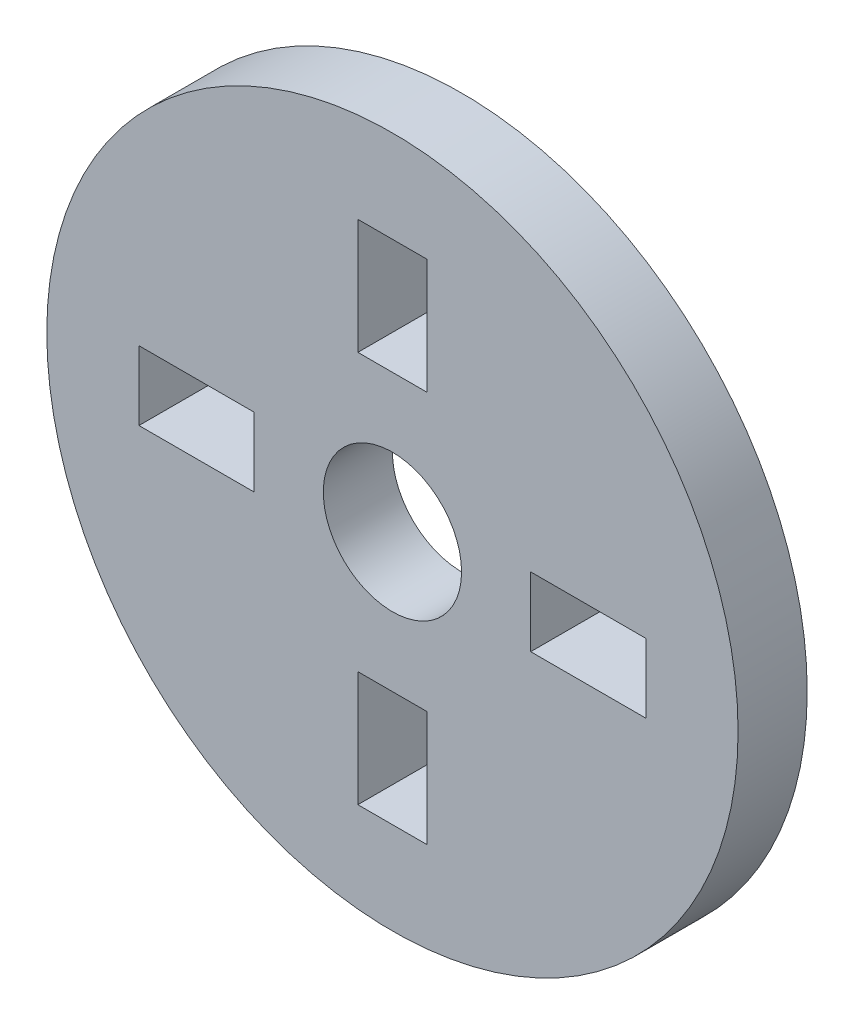
ISO-10303-21;
HEADER;
FILE_DESCRIPTION(('STEP AP214'),'2;1');
FILE_NAME('part.step','',(''),(''),'','','');
FILE_SCHEMA(('AUTOMOTIVE_DESIGN { 1 0 10303 214 1 1 1 1 }'));
ENDSEC;
DATA;
#1=APPLICATION_CONTEXT('core data for automotive mechanical design processes');
#2=APPLICATION_PROTOCOL_DEFINITION('international standard','automotive_design',2000,#1);
#3=PRODUCT_CONTEXT('',#1,'mechanical');
#4=PRODUCT('Part','Part','',(#3));
#5=PRODUCT_RELATED_PRODUCT_CATEGORY('part','',(#4));
#6=PRODUCT_DEFINITION_FORMATION('','',#4);
#7=PRODUCT_DEFINITION_CONTEXT('part definition',#1,'design');
#8=PRODUCT_DEFINITION('design','',#6,#7);
#9=PRODUCT_DEFINITION_SHAPE('','',#8);
#10=(LENGTH_UNIT() NAMED_UNIT(*) SI_UNIT(.MILLI.,.METRE.));
#11=(NAMED_UNIT(*) PLANE_ANGLE_UNIT() SI_UNIT($,.RADIAN.));
#12=(NAMED_UNIT(*) SI_UNIT($,.STERADIAN.) SOLID_ANGLE_UNIT());
#13=UNCERTAINTY_MEASURE_WITH_UNIT(LENGTH_MEASURE(1.E-05),#10,'distance_accuracy_value','');
#14=(GEOMETRIC_REPRESENTATION_CONTEXT(3) GLOBAL_UNCERTAINTY_ASSIGNED_CONTEXT((#13)) GLOBAL_UNIT_ASSIGNED_CONTEXT((#10,
#11,#12)) REPRESENTATION_CONTEXT('',''));
#15=CARTESIAN_POINT('',(0.,0.,0.));
#16=DIRECTION('',(0.,0.,1.));
#17=DIRECTION('',(1.,0.,0.));
#18=AXIS2_PLACEMENT_3D('',#15,#16,#17);
#19=CARTESIAN_POINT('',(0.,0.,3.));
#20=DIRECTION('',(0.,0.,1.));
#21=DIRECTION('',(1.,0.,0.));
#22=AXIS2_PLACEMENT_3D('',#19,#20,#21);
#23=PLANE('',#22);
#24=DIRECTION('',(0.,1.,0.));
#25=VECTOR('',#24,1.);
#26=CARTESIAN_POINT('',(1.5,6.,3.));
#27=LINE('',#26,#25);
#28=CARTESIAN_POINT('',(1.5,6.,3.));
#29=VERTEX_POINT('',#28);
#30=CARTESIAN_POINT('',(1.5,11.,3.));
#31=VERTEX_POINT('',#30);
#32=EDGE_CURVE('E59',#29,#31,#27,.T.);
#33=ORIENTED_EDGE('',*,*,#32,.F.);
#34=DIRECTION('',(1.,0.,0.));
#35=VECTOR('',#34,1.);
#36=CARTESIAN_POINT('',(-1.5,6.,3.));
#37=LINE('',#36,#35);
#38=CARTESIAN_POINT('',(-1.5,6.,3.));
#39=VERTEX_POINT('',#38);
#40=EDGE_CURVE('E181',#39,#29,#37,.T.);
#41=ORIENTED_EDGE('',*,*,#40,.F.);
#42=DIRECTION('',(0.,-1.,0.));
#43=VECTOR('',#42,1.);
#44=CARTESIAN_POINT('',(-1.5,6.,3.));
#45=LINE('',#44,#43);
#46=CARTESIAN_POINT('',(-1.5,11.,3.));
#47=VERTEX_POINT('',#46);
#48=EDGE_CURVE('E185',#47,#39,#45,.T.);
#49=ORIENTED_EDGE('',*,*,#48,.F.);
#50=DIRECTION('',(-1.,0.,0.));
#51=VECTOR('',#50,1.);
#52=CARTESIAN_POINT('',(-1.5,11.,3.));
#53=LINE('',#52,#51);
#54=EDGE_CURVE('E194',#31,#47,#53,.T.);
#55=ORIENTED_EDGE('',*,*,#54,.F.);
#56=EDGE_LOOP('',(#33,#41,#49,#55));
#57=FACE_BOUND('',#56,.T.);
#58=DIRECTION('',(0.,1.,0.));
#59=VECTOR('',#58,1.);
#60=CARTESIAN_POINT('',(11.,1.49999999999996,3.));
#61=LINE('',#60,#59);
#62=CARTESIAN_POINT('',(11.,-1.50000000000004,3.));
#63=VERTEX_POINT('',#62);
#64=CARTESIAN_POINT('',(11.,1.49999999999996,3.));
#65=VERTEX_POINT('',#64);
#66=EDGE_CURVE('E67',#63,#65,#61,.T.);
#67=ORIENTED_EDGE('',*,*,#66,.F.);
#68=DIRECTION('',(1.,0.,0.));
#69=VECTOR('',#68,1.);
#70=CARTESIAN_POINT('',(5.99999999999999,-1.50000000000002,3.));
#71=LINE('',#70,#69);
#72=CARTESIAN_POINT('',(5.99999999999999,-1.50000000000002,3.));
#73=VERTEX_POINT('',#72);
#74=EDGE_CURVE('E223',#73,#63,#71,.T.);
#75=ORIENTED_EDGE('',*,*,#74,.F.);
#76=DIRECTION('',(0.,-1.,0.));
#77=VECTOR('',#76,1.);
#78=CARTESIAN_POINT('',(6.00000000000001,1.49999999999998,3.));
#79=LINE('',#78,#77);
#80=CARTESIAN_POINT('',(6.00000000000001,1.49999999999998,3.));
#81=VERTEX_POINT('',#80);
#82=EDGE_CURVE('E227',#81,#73,#79,.T.);
#83=ORIENTED_EDGE('',*,*,#82,.F.);
#84=DIRECTION('',(-1.,0.,0.));
#85=VECTOR('',#84,1.);
#86=CARTESIAN_POINT('',(6.00000000000001,1.49999999999998,3.));
#87=LINE('',#86,#85);
#88=EDGE_CURVE('E232',#65,#81,#87,.T.);
#89=ORIENTED_EDGE('',*,*,#88,.F.);
#90=EDGE_LOOP('',(#67,#75,#83,#89));
#91=FACE_BOUND('',#90,.T.);
#92=DIRECTION('',(1.,0.,0.));
#93=VECTOR('',#92,1.);
#94=CARTESIAN_POINT('',(1.50000000000017,-11.,3.));
#95=LINE('',#94,#93);
#96=CARTESIAN_POINT('',(-1.49999999999983,-11.,3.));
#97=VERTEX_POINT('',#96);
#98=CARTESIAN_POINT('',(1.50000000000017,-11.,3.));
#99=VERTEX_POINT('',#98);
#100=EDGE_CURVE('E222',#97,#99,#95,.T.);
#101=ORIENTED_EDGE('',*,*,#100,.F.);
#102=DIRECTION('',(0.,-1.,0.));
#103=VECTOR('',#102,1.);
#104=CARTESIAN_POINT('',(-1.50000000000004,-5.99999999999999,3.));
#105=LINE('',#104,#103);
#106=CARTESIAN_POINT('',(-1.50000000000004,-5.99999999999999,3.));
#107=VERTEX_POINT('',#106);
#108=EDGE_CURVE('E267',#107,#97,#105,.T.);
#109=ORIENTED_EDGE('',*,*,#108,.F.);
#110=DIRECTION('',(-1.,0.,0.));
#111=VECTOR('',#110,1.);
#112=CARTESIAN_POINT('',(1.49999999999996,-6.00000000000001,3.));
#113=LINE('',#112,#111);
#114=CARTESIAN_POINT('',(1.49999999999996,-6.00000000000001,3.));
#115=VERTEX_POINT('',#114);
#116=EDGE_CURVE('E271',#115,#107,#113,.T.);
#117=ORIENTED_EDGE('',*,*,#116,.F.);
#118=DIRECTION('',(0.,1.,0.));
#119=VECTOR('',#118,1.);
#120=CARTESIAN_POINT('',(1.49999999999996,-6.00000000000001,3.));
#121=LINE('',#120,#119);
#122=EDGE_CURVE('E276',#99,#115,#121,.T.);
#123=ORIENTED_EDGE('',*,*,#122,.F.);
#124=EDGE_LOOP('',(#101,#109,#117,#123));
#125=FACE_BOUND('',#124,.T.);
#126=DIRECTION('',(0.,-1.,0.));
#127=VECTOR('',#126,1.);
#128=CARTESIAN_POINT('',(-11.,-1.49999999999988,3.));
#129=LINE('',#128,#127);
#130=CARTESIAN_POINT('',(-11.,1.50000000000012,3.));
#131=VERTEX_POINT('',#130);
#132=CARTESIAN_POINT('',(-11.,-1.49999999999988,3.));
#133=VERTEX_POINT('',#132);
#134=EDGE_CURVE('E266',#131,#133,#129,.T.);
#135=ORIENTED_EDGE('',*,*,#134,.F.);
#136=DIRECTION('',(-1.,0.,0.));
#137=VECTOR('',#136,1.);
#138=CARTESIAN_POINT('',(-5.99999999999998,1.50000000000006,3.));
#139=LINE('',#138,#137);
#140=CARTESIAN_POINT('',(-5.99999999999998,1.50000000000006,3.));
#141=VERTEX_POINT('',#140);
#142=EDGE_CURVE('E310',#141,#131,#139,.T.);
#143=ORIENTED_EDGE('',*,*,#142,.F.);
#144=DIRECTION('',(0.,1.,0.));
#145=VECTOR('',#144,1.);
#146=CARTESIAN_POINT('',(-6.00000000000002,-1.49999999999994,3.));
#147=LINE('',#146,#145);
#148=CARTESIAN_POINT('',(-6.00000000000002,-1.49999999999994,3.));
#149=VERTEX_POINT('',#148);
#150=EDGE_CURVE('E314',#149,#141,#147,.T.);
#151=ORIENTED_EDGE('',*,*,#150,.F.);
#152=DIRECTION('',(1.,0.,0.));
#153=VECTOR('',#152,1.);
#154=CARTESIAN_POINT('',(-6.00000000000002,-1.49999999999994,3.));
#155=LINE('',#154,#153);
#156=EDGE_CURVE('E319',#133,#149,#155,.T.);
#157=ORIENTED_EDGE('',*,*,#156,.F.);
#158=EDGE_LOOP('',(#135,#143,#151,#157));
#159=FACE_BOUND('',#158,.T.);
#160=CARTESIAN_POINT('',(0.,0.,3.));
#161=DIRECTION('',(0.,0.,1.));
#162=DIRECTION('',(1.,0.,0.));
#163=AXIS2_PLACEMENT_3D('',#160,#161,#162);
#164=CIRCLE('',#163,15.);
#165=CARTESIAN_POINT('',(15.,0.,3.));
#166=VERTEX_POINT('',#165);
#167=EDGE_CURVE('E11',#166,#166,#164,.T.);
#168=ORIENTED_EDGE('',*,*,#167,.T.);
#169=EDGE_LOOP('',(#168));
#170=FACE_BOUND('',#169,.T.);
#171=CARTESIAN_POINT('',(0.,0.,3.));
#172=DIRECTION('',(0.,0.,1.));
#173=DIRECTION('',(1.,0.,0.));
#174=AXIS2_PLACEMENT_3D('',#171,#172,#173);
#175=CIRCLE('',#174,3.);
#176=CARTESIAN_POINT('',(3.,0.,3.));
#177=VERTEX_POINT('',#176);
#178=EDGE_CURVE('E339',#177,#177,#175,.T.);
#179=ORIENTED_EDGE('',*,*,#178,.F.);
#180=EDGE_LOOP('',(#179));
#181=FACE_BOUND('',#180,.T.);
#182=ADVANCED_FACE('F43',(#57,#91,#125,#159,#170,#181),#23,.T.);
#183=CARTESIAN_POINT('',(0.,0.,0.));
#184=DIRECTION('',(0.,0.,1.));
#185=DIRECTION('',(1.,0.,0.));
#186=AXIS2_PLACEMENT_3D('',#183,#184,#185);
#187=PLANE('',#186);
#188=DIRECTION('',(1.,0.,0.));
#189=VECTOR('',#188,1.);
#190=CARTESIAN_POINT('',(-1.5,6.,0.));
#191=LINE('',#190,#189);
#192=CARTESIAN_POINT('',(-1.5,6.,0.));
#193=VERTEX_POINT('',#192);
#194=CARTESIAN_POINT('',(1.5,6.,0.));
#195=VERTEX_POINT('',#194);
#196=EDGE_CURVE('E166',#193,#195,#191,.T.);
#197=ORIENTED_EDGE('',*,*,#196,.T.);
#198=DIRECTION('',(0.,1.,0.));
#199=VECTOR('',#198,1.);
#200=CARTESIAN_POINT('',(1.5,6.,0.));
#201=LINE('',#200,#199);
#202=CARTESIAN_POINT('',(1.5,11.,0.));
#203=VERTEX_POINT('',#202);
#204=EDGE_CURVE('E159',#195,#203,#201,.T.);
#205=ORIENTED_EDGE('',*,*,#204,.T.);
#206=DIRECTION('',(-1.,0.,0.));
#207=VECTOR('',#206,1.);
#208=CARTESIAN_POINT('',(-1.5,11.,0.));
#209=LINE('',#208,#207);
#210=CARTESIAN_POINT('',(-1.5,11.,0.));
#211=VERTEX_POINT('',#210);
#212=EDGE_CURVE('E170',#203,#211,#209,.T.);
#213=ORIENTED_EDGE('',*,*,#212,.T.);
#214=DIRECTION('',(0.,-1.,0.));
#215=VECTOR('',#214,1.);
#216=CARTESIAN_POINT('',(-1.5,6.,0.));
#217=LINE('',#216,#215);
#218=EDGE_CURVE('E175',#211,#193,#217,.T.);
#219=ORIENTED_EDGE('',*,*,#218,.T.);
#220=EDGE_LOOP('',(#197,#205,#213,#219));
#221=FACE_BOUND('',#220,.T.);
#222=DIRECTION('',(1.,0.,0.));
#223=VECTOR('',#222,1.);
#224=CARTESIAN_POINT('',(5.99999999999999,-1.50000000000002,0.));
#225=LINE('',#224,#223);
#226=CARTESIAN_POINT('',(5.99999999999999,-1.50000000000002,0.));
#227=VERTEX_POINT('',#226);
#228=CARTESIAN_POINT('',(11.,-1.50000000000004,0.));
#229=VERTEX_POINT('',#228);
#230=EDGE_CURVE('E212',#227,#229,#225,.T.);
#231=ORIENTED_EDGE('',*,*,#230,.T.);
#232=DIRECTION('',(0.,1.,0.));
#233=VECTOR('',#232,1.);
#234=CARTESIAN_POINT('',(11.,1.49999999999996,0.));
#235=LINE('',#234,#233);
#236=CARTESIAN_POINT('',(11.,1.49999999999996,0.));
#237=VERTEX_POINT('',#236);
#238=EDGE_CURVE('E228',#229,#237,#235,.T.);
#239=ORIENTED_EDGE('',*,*,#238,.T.);
#240=DIRECTION('',(-1.,0.,0.));
#241=VECTOR('',#240,1.);
#242=CARTESIAN_POINT('',(6.00000000000001,1.49999999999998,0.));
#243=LINE('',#242,#241);
#244=CARTESIAN_POINT('',(6.00000000000001,1.49999999999998,0.));
#245=VERTEX_POINT('',#244);
#246=EDGE_CURVE('E245',#237,#245,#243,.T.);
#247=ORIENTED_EDGE('',*,*,#246,.T.);
#248=DIRECTION('',(0.,-1.,0.));
#249=VECTOR('',#248,1.);
#250=CARTESIAN_POINT('',(6.00000000000001,1.49999999999998,0.));
#251=LINE('',#250,#249);
#252=EDGE_CURVE('E241',#245,#227,#251,.T.);
#253=ORIENTED_EDGE('',*,*,#252,.T.);
#254=EDGE_LOOP('',(#231,#239,#247,#253));
#255=FACE_BOUND('',#254,.T.);
#256=DIRECTION('',(0.,-1.,0.));
#257=VECTOR('',#256,1.);
#258=CARTESIAN_POINT('',(-1.50000000000004,-5.99999999999999,0.));
#259=LINE('',#258,#257);
#260=CARTESIAN_POINT('',(-1.50000000000004,-5.99999999999999,0.));
#261=VERTEX_POINT('',#260);
#262=CARTESIAN_POINT('',(-1.49999999999983,-11.,0.));
#263=VERTEX_POINT('',#262);
#264=EDGE_CURVE('E256',#261,#263,#259,.T.);
#265=ORIENTED_EDGE('',*,*,#264,.T.);
#266=DIRECTION('',(1.,0.,0.));
#267=VECTOR('',#266,1.);
#268=CARTESIAN_POINT('',(1.50000000000017,-11.,0.));
#269=LINE('',#268,#267);
#270=CARTESIAN_POINT('',(1.50000000000017,-11.,0.));
#271=VERTEX_POINT('',#270);
#272=EDGE_CURVE('E272',#263,#271,#269,.T.);
#273=ORIENTED_EDGE('',*,*,#272,.T.);
#274=DIRECTION('',(0.,1.,0.));
#275=VECTOR('',#274,1.);
#276=CARTESIAN_POINT('',(1.49999999999996,-6.00000000000001,0.));
#277=LINE('',#276,#275);
#278=CARTESIAN_POINT('',(1.49999999999996,-6.00000000000001,0.));
#279=VERTEX_POINT('',#278);
#280=EDGE_CURVE('E289',#271,#279,#277,.T.);
#281=ORIENTED_EDGE('',*,*,#280,.T.);
#282=DIRECTION('',(-1.,0.,0.));
#283=VECTOR('',#282,1.);
#284=CARTESIAN_POINT('',(1.49999999999996,-6.00000000000001,0.));
#285=LINE('',#284,#283);
#286=EDGE_CURVE('E285',#279,#261,#285,.T.);
#287=ORIENTED_EDGE('',*,*,#286,.T.);
#288=EDGE_LOOP('',(#265,#273,#281,#287));
#289=FACE_BOUND('',#288,.T.);
#290=DIRECTION('',(-1.,0.,0.));
#291=VECTOR('',#290,1.);
#292=CARTESIAN_POINT('',(-5.99999999999998,1.50000000000006,0.));
#293=LINE('',#292,#291);
#294=CARTESIAN_POINT('',(-5.99999999999998,1.50000000000006,0.));
#295=VERTEX_POINT('',#294);
#296=CARTESIAN_POINT('',(-11.,1.50000000000012,0.));
#297=VERTEX_POINT('',#296);
#298=EDGE_CURVE('E300',#295,#297,#293,.T.);
#299=ORIENTED_EDGE('',*,*,#298,.T.);
#300=DIRECTION('',(0.,-1.,0.));
#301=VECTOR('',#300,1.);
#302=CARTESIAN_POINT('',(-11.,-1.49999999999988,0.));
#303=LINE('',#302,#301);
#304=CARTESIAN_POINT('',(-11.,-1.49999999999988,0.));
#305=VERTEX_POINT('',#304);
#306=EDGE_CURVE('E315',#297,#305,#303,.T.);
#307=ORIENTED_EDGE('',*,*,#306,.T.);
#308=DIRECTION('',(1.,0.,0.));
#309=VECTOR('',#308,1.);
#310=CARTESIAN_POINT('',(-6.00000000000002,-1.49999999999994,0.));
#311=LINE('',#310,#309);
#312=CARTESIAN_POINT('',(-6.00000000000002,-1.49999999999994,0.));
#313=VERTEX_POINT('',#312);
#314=EDGE_CURVE('E332',#305,#313,#311,.T.);
#315=ORIENTED_EDGE('',*,*,#314,.T.);
#316=DIRECTION('',(0.,1.,0.));
#317=VECTOR('',#316,1.);
#318=CARTESIAN_POINT('',(-6.00000000000002,-1.49999999999994,0.));
#319=LINE('',#318,#317);
#320=EDGE_CURVE('E328',#313,#295,#319,.T.);
#321=ORIENTED_EDGE('',*,*,#320,.T.);
#322=EDGE_LOOP('',(#299,#307,#315,#321));
#323=FACE_BOUND('',#322,.T.);
#324=CARTESIAN_POINT('',(0.,0.,0.));
#325=DIRECTION('',(0.,0.,1.));
#326=DIRECTION('',(1.,0.,0.));
#327=AXIS2_PLACEMENT_3D('',#324,#325,#326);
#328=CIRCLE('',#327,15.);
#329=CARTESIAN_POINT('',(15.,0.,0.));
#330=VERTEX_POINT('',#329);
#331=EDGE_CURVE('E47',#330,#330,#328,.T.);
#332=ORIENTED_EDGE('',*,*,#331,.F.);
#333=EDGE_LOOP('',(#332));
#334=FACE_BOUND('',#333,.T.);
#335=CARTESIAN_POINT('',(0.,0.,0.));
#336=DIRECTION('',(0.,0.,1.));
#337=DIRECTION('',(1.,0.,0.));
#338=AXIS2_PLACEMENT_3D('',#335,#336,#337);
#339=CIRCLE('',#338,3.);
#340=CARTESIAN_POINT('',(3.,0.,0.));
#341=VERTEX_POINT('',#340);
#342=EDGE_CURVE('E203',#341,#341,#339,.T.);
#343=ORIENTED_EDGE('',*,*,#342,.T.);
#344=EDGE_LOOP('',(#343));
#345=FACE_BOUND('',#344,.T.);
#346=ADVANCED_FACE('F177',(#221,#255,#289,#323,#334,#345),#187,.F.);
#347=CARTESIAN_POINT('',(0.,0.,3.));
#348=DIRECTION('',(0.,0.,-1.));
#349=DIRECTION('',(-1.,0.,0.));
#350=AXIS2_PLACEMENT_3D('',#347,#348,#349);
#351=CYLINDRICAL_SURFACE('',#350,15.);
#352=ORIENTED_EDGE('',*,*,#167,.F.);
#353=EDGE_LOOP('',(#352));
#354=FACE_BOUND('',#353,.T.);
#355=ORIENTED_EDGE('',*,*,#331,.T.);
#356=EDGE_LOOP('',(#355));
#357=FACE_BOUND('',#356,.T.);
#358=ADVANCED_FACE('F45',(#354,#357),#351,.T.);
#359=CARTESIAN_POINT('',(0.,0.,3.));
#360=DIRECTION('',(0.,0.,-1.));
#361=DIRECTION('',(-1.,0.,0.));
#362=AXIS2_PLACEMENT_3D('',#359,#360,#361);
#363=CYLINDRICAL_SURFACE('',#362,3.);
#364=ORIENTED_EDGE('',*,*,#178,.T.);
#365=EDGE_LOOP('',(#364));
#366=FACE_BOUND('',#365,.T.);
#367=ORIENTED_EDGE('',*,*,#342,.F.);
#368=EDGE_LOOP('',(#367));
#369=FACE_BOUND('',#368,.T.);
#370=ADVANCED_FACE('F348',(#366,#369),#363,.F.);
#371=CARTESIAN_POINT('',(-11.,-1.49999999999988,0.));
#372=DIRECTION('',(-1.,0.,0.));
#373=DIRECTION('',(0.,-1.,0.));
#374=AXIS2_PLACEMENT_3D('',#371,#372,#373);
#375=PLANE('',#374);
#376=ORIENTED_EDGE('',*,*,#134,.T.);
#377=DIRECTION('',(0.,0.,1.));
#378=VECTOR('',#377,1.);
#379=CARTESIAN_POINT('',(-11.,-1.49999999999988,0.));
#380=LINE('',#379,#378);
#381=EDGE_CURVE('E296',#305,#133,#380,.T.);
#382=ORIENTED_EDGE('',*,*,#381,.F.);
#383=ORIENTED_EDGE('',*,*,#306,.F.);
#384=DIRECTION('',(0.,0.,1.));
#385=VECTOR('',#384,1.);
#386=CARTESIAN_POINT('',(-11.,1.50000000000012,0.));
#387=LINE('',#386,#385);
#388=EDGE_CURVE('E307',#297,#131,#387,.T.);
#389=ORIENTED_EDGE('',*,*,#388,.T.);
#390=EDGE_LOOP('',(#376,#382,#383,#389));
#391=FACE_BOUND('',#390,.T.);
#392=ADVANCED_FACE('F350',(#391),#375,.F.);
#393=CARTESIAN_POINT('',(-5.99999999999998,1.50000000000006,0.));
#394=DIRECTION('',(0.,1.,0.));
#395=DIRECTION('',(-1.,0.,0.));
#396=AXIS2_PLACEMENT_3D('',#393,#394,#395);
#397=PLANE('',#396);
#398=ORIENTED_EDGE('',*,*,#142,.T.);
#399=ORIENTED_EDGE('',*,*,#388,.F.);
#400=ORIENTED_EDGE('',*,*,#298,.F.);
#401=DIRECTION('',(0.,0.,1.));
#402=VECTOR('',#401,1.);
#403=CARTESIAN_POINT('',(-5.99999999999998,1.50000000000006,0.));
#404=LINE('',#403,#402);
#405=EDGE_CURVE('E304',#295,#141,#404,.T.);
#406=ORIENTED_EDGE('',*,*,#405,.T.);
#407=EDGE_LOOP('',(#398,#399,#400,#406));
#408=FACE_BOUND('',#407,.T.);
#409=ADVANCED_FACE('F357',(#408),#397,.F.);
#410=CARTESIAN_POINT('',(-6.00000000000002,-1.49999999999994,0.));
#411=DIRECTION('',(1.,0.,0.));
#412=DIRECTION('',(0.,1.,0.));
#413=AXIS2_PLACEMENT_3D('',#410,#411,#412);
#414=PLANE('',#413);
#415=ORIENTED_EDGE('',*,*,#150,.T.);
#416=ORIENTED_EDGE('',*,*,#405,.F.);
#417=ORIENTED_EDGE('',*,*,#320,.F.);
#418=DIRECTION('',(0.,0.,1.));
#419=VECTOR('',#418,1.);
#420=CARTESIAN_POINT('',(-6.00000000000002,-1.49999999999994,0.));
#421=LINE('',#420,#419);
#422=EDGE_CURVE('E301',#313,#149,#421,.T.);
#423=ORIENTED_EDGE('',*,*,#422,.T.);
#424=EDGE_LOOP('',(#415,#416,#417,#423));
#425=FACE_BOUND('',#424,.T.);
#426=ADVANCED_FACE('F399',(#425),#414,.F.);
#427=CARTESIAN_POINT('',(-6.00000000000002,-1.49999999999994,0.));
#428=DIRECTION('',(0.,-1.,0.));
#429=DIRECTION('',(1.,0.,0.));
#430=AXIS2_PLACEMENT_3D('',#427,#428,#429);
#431=PLANE('',#430);
#432=ORIENTED_EDGE('',*,*,#156,.T.);
#433=ORIENTED_EDGE('',*,*,#422,.F.);
#434=ORIENTED_EDGE('',*,*,#314,.F.);
#435=ORIENTED_EDGE('',*,*,#381,.T.);
#436=EDGE_LOOP('',(#432,#433,#434,#435));
#437=FACE_BOUND('',#436,.T.);
#438=ADVANCED_FACE('F393',(#437),#431,.F.);
#439=CARTESIAN_POINT('',(1.50000000000017,-11.,0.));
#440=DIRECTION('',(0.,-1.,0.));
#441=DIRECTION('',(0.,0.,-1.));
#442=AXIS2_PLACEMENT_3D('',#439,#440,#441);
#443=PLANE('',#442);
#444=ORIENTED_EDGE('',*,*,#100,.T.);
#445=DIRECTION('',(0.,0.,1.));
#446=VECTOR('',#445,1.);
#447=CARTESIAN_POINT('',(1.50000000000017,-11.,0.));
#448=LINE('',#447,#446);
#449=EDGE_CURVE('E252',#271,#99,#448,.T.);
#450=ORIENTED_EDGE('',*,*,#449,.F.);
#451=ORIENTED_EDGE('',*,*,#272,.F.);
#452=DIRECTION('',(0.,0.,1.));
#453=VECTOR('',#452,1.);
#454=CARTESIAN_POINT('',(-1.49999999999983,-11.,0.));
#455=LINE('',#454,#453);
#456=EDGE_CURVE('E263',#263,#97,#455,.T.);
#457=ORIENTED_EDGE('',*,*,#456,.T.);
#458=EDGE_LOOP('',(#444,#450,#451,#457));
#459=FACE_BOUND('',#458,.T.);
#460=ADVANCED_FACE('F406',(#459),#443,.F.);
#461=CARTESIAN_POINT('',(-1.50000000000004,-5.99999999999999,0.));
#462=DIRECTION('',(-1.,0.,0.));
#463=DIRECTION('',(0.,-1.,0.));
#464=AXIS2_PLACEMENT_3D('',#461,#462,#463);
#465=PLANE('',#464);
#466=ORIENTED_EDGE('',*,*,#108,.T.);
#467=ORIENTED_EDGE('',*,*,#456,.F.);
#468=ORIENTED_EDGE('',*,*,#264,.F.);
#469=DIRECTION('',(0.,0.,1.));
#470=VECTOR('',#469,1.);
#471=CARTESIAN_POINT('',(-1.50000000000004,-5.99999999999999,0.));
#472=LINE('',#471,#470);
#473=EDGE_CURVE('E260',#261,#107,#472,.T.);
#474=ORIENTED_EDGE('',*,*,#473,.T.);
#475=EDGE_LOOP('',(#466,#467,#468,#474));
#476=FACE_BOUND('',#475,.T.);
#477=ADVANCED_FACE('F409',(#476),#465,.F.);
#478=CARTESIAN_POINT('',(1.49999999999996,-6.00000000000001,0.));
#479=DIRECTION('',(0.,1.,0.));
#480=DIRECTION('',(-1.,0.,0.));
#481=AXIS2_PLACEMENT_3D('',#478,#479,#480);
#482=PLANE('',#481);
#483=ORIENTED_EDGE('',*,*,#116,.T.);
#484=ORIENTED_EDGE('',*,*,#473,.F.);
#485=ORIENTED_EDGE('',*,*,#286,.F.);
#486=DIRECTION('',(0.,0.,1.));
#487=VECTOR('',#486,1.);
#488=CARTESIAN_POINT('',(1.49999999999996,-6.00000000000001,0.));
#489=LINE('',#488,#487);
#490=EDGE_CURVE('E257',#279,#115,#489,.T.);
#491=ORIENTED_EDGE('',*,*,#490,.T.);
#492=EDGE_LOOP('',(#483,#484,#485,#491));
#493=FACE_BOUND('',#492,.T.);
#494=ADVANCED_FACE('F412',(#493),#482,.F.);
#495=CARTESIAN_POINT('',(1.49999999999996,-6.00000000000001,0.));
#496=DIRECTION('',(1.,0.,0.));
#497=DIRECTION('',(0.,1.,0.));
#498=AXIS2_PLACEMENT_3D('',#495,#496,#497);
#499=PLANE('',#498);
#500=ORIENTED_EDGE('',*,*,#122,.T.);
#501=ORIENTED_EDGE('',*,*,#490,.F.);
#502=ORIENTED_EDGE('',*,*,#280,.F.);
#503=ORIENTED_EDGE('',*,*,#449,.T.);
#504=EDGE_LOOP('',(#500,#501,#502,#503));
#505=FACE_BOUND('',#504,.T.);
#506=ADVANCED_FACE('F416',(#505),#499,.F.);
#507=CARTESIAN_POINT('',(11.,1.49999999999996,0.));
#508=DIRECTION('',(1.,0.,0.));
#509=DIRECTION('',(0.,1.,0.));
#510=AXIS2_PLACEMENT_3D('',#507,#508,#509);
#511=PLANE('',#510);
#512=ORIENTED_EDGE('',*,*,#66,.T.);
#513=DIRECTION('',(0.,0.,1.));
#514=VECTOR('',#513,1.);
#515=CARTESIAN_POINT('',(11.,1.49999999999996,0.));
#516=LINE('',#515,#514);
#517=EDGE_CURVE('E209',#237,#65,#516,.T.);
#518=ORIENTED_EDGE('',*,*,#517,.F.);
#519=ORIENTED_EDGE('',*,*,#238,.F.);
#520=DIRECTION('',(0.,0.,1.));
#521=VECTOR('',#520,1.);
#522=CARTESIAN_POINT('',(11.,-1.50000000000004,0.));
#523=LINE('',#522,#521);
#524=EDGE_CURVE('E219',#229,#63,#523,.T.);
#525=ORIENTED_EDGE('',*,*,#524,.T.);
#526=EDGE_LOOP('',(#512,#518,#519,#525));
#527=FACE_BOUND('',#526,.T.);
#528=ADVANCED_FACE('F420',(#527),#511,.F.);
#529=CARTESIAN_POINT('',(5.99999999999999,-1.50000000000002,0.));
#530=DIRECTION('',(0.,-1.,0.));
#531=DIRECTION('',(1.,0.,0.));
#532=AXIS2_PLACEMENT_3D('',#529,#530,#531);
#533=PLANE('',#532);
#534=ORIENTED_EDGE('',*,*,#74,.T.);
#535=ORIENTED_EDGE('',*,*,#524,.F.);
#536=ORIENTED_EDGE('',*,*,#230,.F.);
#537=DIRECTION('',(0.,0.,1.));
#538=VECTOR('',#537,1.);
#539=CARTESIAN_POINT('',(5.99999999999999,-1.50000000000002,0.));
#540=LINE('',#539,#538);
#541=EDGE_CURVE('E216',#227,#73,#540,.T.);
#542=ORIENTED_EDGE('',*,*,#541,.T.);
#543=EDGE_LOOP('',(#534,#535,#536,#542));
#544=FACE_BOUND('',#543,.T.);
#545=ADVANCED_FACE('F425',(#544),#533,.F.);
#546=CARTESIAN_POINT('',(6.00000000000001,1.49999999999998,0.));
#547=DIRECTION('',(-1.,0.,0.));
#548=DIRECTION('',(0.,-1.,0.));
#549=AXIS2_PLACEMENT_3D('',#546,#547,#548);
#550=PLANE('',#549);
#551=ORIENTED_EDGE('',*,*,#82,.T.);
#552=ORIENTED_EDGE('',*,*,#541,.F.);
#553=ORIENTED_EDGE('',*,*,#252,.F.);
#554=DIRECTION('',(0.,0.,1.));
#555=VECTOR('',#554,1.);
#556=CARTESIAN_POINT('',(6.00000000000001,1.49999999999998,0.));
#557=LINE('',#556,#555);
#558=EDGE_CURVE('E213',#245,#81,#557,.T.);
#559=ORIENTED_EDGE('',*,*,#558,.T.);
#560=EDGE_LOOP('',(#551,#552,#553,#559));
#561=FACE_BOUND('',#560,.T.);
#562=ADVANCED_FACE('F428',(#561),#550,.F.);
#563=CARTESIAN_POINT('',(6.00000000000001,1.49999999999998,0.));
#564=DIRECTION('',(0.,1.,0.));
#565=DIRECTION('',(-1.,0.,0.));
#566=AXIS2_PLACEMENT_3D('',#563,#564,#565);
#567=PLANE('',#566);
#568=ORIENTED_EDGE('',*,*,#88,.T.);
#569=ORIENTED_EDGE('',*,*,#558,.F.);
#570=ORIENTED_EDGE('',*,*,#246,.F.);
#571=ORIENTED_EDGE('',*,*,#517,.T.);
#572=EDGE_LOOP('',(#568,#569,#570,#571));
#573=FACE_BOUND('',#572,.T.);
#574=ADVANCED_FACE('F432',(#573),#567,.F.);
#575=CARTESIAN_POINT('',(1.5,6.,0.));
#576=DIRECTION('',(1.,0.,0.));
#577=DIRECTION('',(0.,0.,-1.));
#578=AXIS2_PLACEMENT_3D('',#575,#576,#577);
#579=PLANE('',#578);
#580=ORIENTED_EDGE('',*,*,#32,.T.);
#581=DIRECTION('',(0.,0.,1.));
#582=VECTOR('',#581,1.);
#583=CARTESIAN_POINT('',(1.5,11.,0.));
#584=LINE('',#583,#582);
#585=EDGE_CURVE('E155',#203,#31,#584,.T.);
#586=ORIENTED_EDGE('',*,*,#585,.F.);
#587=ORIENTED_EDGE('',*,*,#204,.F.);
#588=DIRECTION('',(0.,0.,1.));
#589=VECTOR('',#588,1.);
#590=CARTESIAN_POINT('',(1.5,6.,0.));
#591=LINE('',#590,#589);
#592=EDGE_CURVE('E200',#195,#29,#591,.T.);
#593=ORIENTED_EDGE('',*,*,#592,.T.);
#594=EDGE_LOOP('',(#580,#586,#587,#593));
#595=FACE_BOUND('',#594,.T.);
#596=ADVANCED_FACE('F157',(#595),#579,.F.);
#597=CARTESIAN_POINT('',(-1.5,6.,0.));
#598=DIRECTION('',(0.,-1.,0.));
#599=DIRECTION('',(0.,0.,-1.));
#600=AXIS2_PLACEMENT_3D('',#597,#598,#599);
#601=PLANE('',#600);
#602=ORIENTED_EDGE('',*,*,#40,.T.);
#603=ORIENTED_EDGE('',*,*,#592,.F.);
#604=ORIENTED_EDGE('',*,*,#196,.F.);
#605=DIRECTION('',(0.,0.,1.));
#606=VECTOR('',#605,1.);
#607=CARTESIAN_POINT('',(-1.5,6.,0.));
#608=LINE('',#607,#606);
#609=EDGE_CURVE('E204',#193,#39,#608,.T.);
#610=ORIENTED_EDGE('',*,*,#609,.T.);
#611=EDGE_LOOP('',(#602,#603,#604,#610));
#612=FACE_BOUND('',#611,.T.);
#613=ADVANCED_FACE('F441',(#612),#601,.F.);
#614=CARTESIAN_POINT('',(-1.5,6.,0.));
#615=DIRECTION('',(-1.,0.,0.));
#616=DIRECTION('',(0.,0.,1.));
#617=AXIS2_PLACEMENT_3D('',#614,#615,#616);
#618=PLANE('',#617);
#619=ORIENTED_EDGE('',*,*,#48,.T.);
#620=ORIENTED_EDGE('',*,*,#609,.F.);
#621=ORIENTED_EDGE('',*,*,#218,.F.);
#622=DIRECTION('',(0.,0.,1.));
#623=VECTOR('',#622,1.);
#624=CARTESIAN_POINT('',(-1.5,11.,0.));
#625=LINE('',#624,#623);
#626=EDGE_CURVE('E165',#211,#47,#625,.T.);
#627=ORIENTED_EDGE('',*,*,#626,.T.);
#628=EDGE_LOOP('',(#619,#620,#621,#627));
#629=FACE_BOUND('',#628,.T.);
#630=ADVANCED_FACE('F444',(#629),#618,.F.);
#631=CARTESIAN_POINT('',(-1.5,11.,0.));
#632=DIRECTION('',(0.,1.,0.));
#633=DIRECTION('',(0.,0.,1.));
#634=AXIS2_PLACEMENT_3D('',#631,#632,#633);
#635=PLANE('',#634);
#636=ORIENTED_EDGE('',*,*,#54,.T.);
#637=ORIENTED_EDGE('',*,*,#626,.F.);
#638=ORIENTED_EDGE('',*,*,#212,.F.);
#639=ORIENTED_EDGE('',*,*,#585,.T.);
#640=EDGE_LOOP('',(#636,#637,#638,#639));
#641=FACE_BOUND('',#640,.T.);
#642=ADVANCED_FACE('F171',(#641),#635,.F.);
#643=CLOSED_SHELL('',(#182,#346,#358,#370,#392,#409,#426,#438,#460,#477,#494,#506,#528,#545,
#562,#574,#596,#613,#630,#642));
#644=MANIFOLD_SOLID_BREP('B2',#643);
#645=ADVANCED_BREP_SHAPE_REPRESENTATION('',(#18,#644),#14);
#646=SHAPE_DEFINITION_REPRESENTATION(#9,#645);
ENDSEC;
END-ISO-10303-21;
